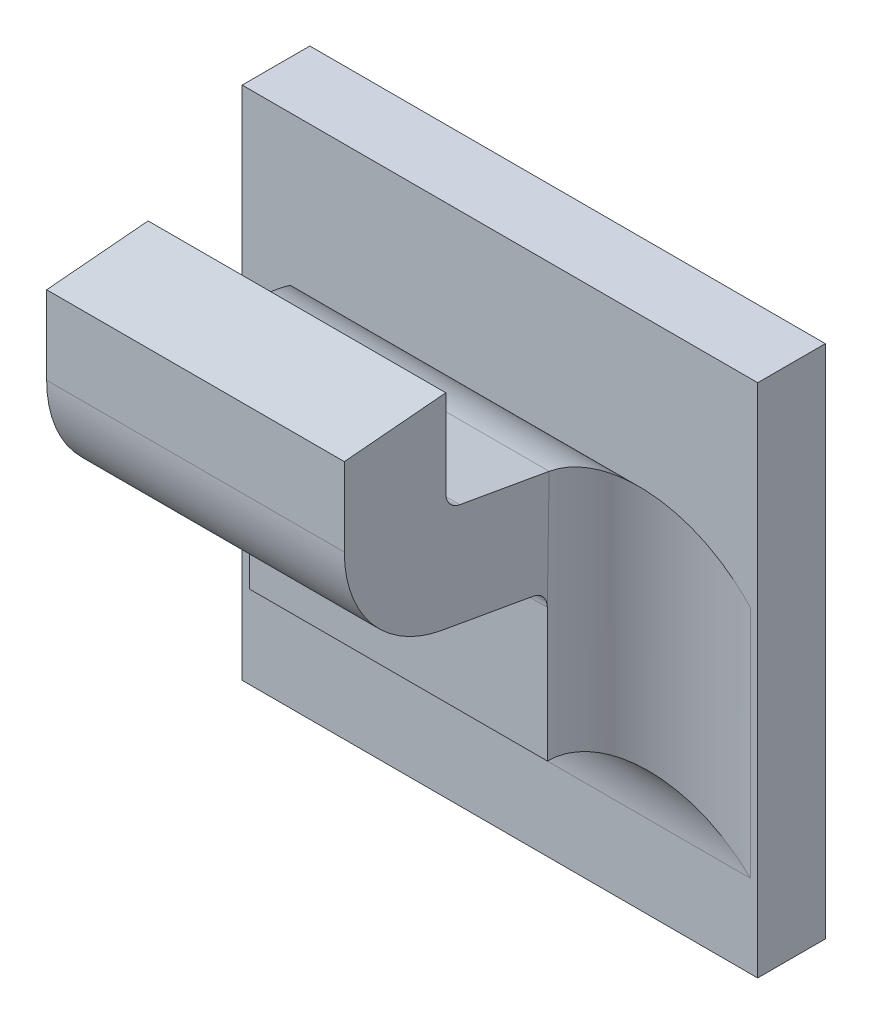
ISO-10303-21;
HEADER;
FILE_DESCRIPTION(('STEP AP214'),'2;1');
FILE_NAME('part.step','',(''),(''),'','','');
FILE_SCHEMA(('AUTOMOTIVE_DESIGN { 1 0 10303 214 1 1 1 1 }'));
ENDSEC;
DATA;
#1=APPLICATION_CONTEXT('core data for automotive mechanical design processes');
#2=APPLICATION_PROTOCOL_DEFINITION('international standard','automotive_design',2000,#1);
#3=PRODUCT_CONTEXT('',#1,'mechanical');
#4=PRODUCT('Part','Part','',(#3));
#5=PRODUCT_RELATED_PRODUCT_CATEGORY('part','',(#4));
#6=PRODUCT_DEFINITION_FORMATION('','',#4);
#7=PRODUCT_DEFINITION_CONTEXT('part definition',#1,'design');
#8=PRODUCT_DEFINITION('design','',#6,#7);
#9=PRODUCT_DEFINITION_SHAPE('','',#8);
#10=(LENGTH_UNIT() NAMED_UNIT(*) SI_UNIT(.MILLI.,.METRE.));
#11=(NAMED_UNIT(*) PLANE_ANGLE_UNIT() SI_UNIT($,.RADIAN.));
#12=(NAMED_UNIT(*) SI_UNIT($,.STERADIAN.) SOLID_ANGLE_UNIT());
#13=UNCERTAINTY_MEASURE_WITH_UNIT(LENGTH_MEASURE(1.E-05),#10,'distance_accuracy_value','');
#14=(GEOMETRIC_REPRESENTATION_CONTEXT(3) GLOBAL_UNCERTAINTY_ASSIGNED_CONTEXT((#13)) GLOBAL_UNIT_ASSIGNED_CONTEXT((#10,
#11,#12)) REPRESENTATION_CONTEXT('',''));
#15=CARTESIAN_POINT('',(0.,0.,0.));
#16=DIRECTION('',(0.,0.,1.));
#17=DIRECTION('',(1.,0.,0.));
#18=AXIS2_PLACEMENT_3D('',#15,#16,#17);
#19=CARTESIAN_POINT('',(-0.50198809134313,-0.481303520617574,0.0797273267071123));
#20=DIRECTION('',(1.,0.,0.));
#21=DIRECTION('',(0.,1.,0.));
#22=AXIS2_PLACEMENT_3D('',#19,#20,#21);
#23=CYLINDRICAL_SURFACE('',#22,0.00098425196850394);
#24=DIRECTION('',(1.,0.,0.));
#25=VECTOR('',#24,1.);
#26=CARTESIAN_POINT('',(-0.521043209453366,-0.481303520617574,0.0807115786756163));
#27=LINE('',#26,#25);
#28=CARTESIAN_POINT('',(-0.502854233075413,-0.481303520617574,0.0807115786756163));
#29=VERTEX_POINT('',#28);
#30=CARTESIAN_POINT('',(-0.520177067721082,-0.481303520617574,0.0807115786756163));
#31=VERTEX_POINT('',#30);
#32=EDGE_CURVE('E182',#29,#31,#27,.F.);
#33=ORIENTED_EDGE('',*,*,#32,.F.);
#34=CARTESIAN_POINT('',(-0.502854233075413,-0.481303520617574,0.0797273267071123));
#35=DIRECTION('',(1.,0.,0.));
#36=DIRECTION('',(0.,1.,0.));
#37=AXIS2_PLACEMENT_3D('',#34,#35,#36);
#38=CIRCLE('',#37,0.00098425196850394);
#39=CARTESIAN_POINT('',(-0.502854233075413,-0.482272819587074,0.0798982402678081));
#40=VERTEX_POINT('',#39);
#41=EDGE_CURVE('E155',#40,#29,#38,.F.);
#42=ORIENTED_EDGE('',*,*,#41,.F.);
#43=DIRECTION('',(1.,0.,0.));
#44=VECTOR('',#43,1.);
#45=CARTESIAN_POINT('',(-0.521047402238024,-0.482272819587074,0.0798982402678081));
#46=LINE('',#45,#44);
#47=CARTESIAN_POINT('',(-0.520177067721082,-0.482272819587074,0.0798982402678081));
#48=VERTEX_POINT('',#47);
#49=EDGE_CURVE('E137',#48,#40,#46,.T.);
#50=ORIENTED_EDGE('',*,*,#49,.F.);
#51=CARTESIAN_POINT('',(-0.520177067721082,-0.481303520617574,0.0797273267071123));
#52=DIRECTION('',(1.,0.,0.));
#53=DIRECTION('',(0.,1.,0.));
#54=AXIS2_PLACEMENT_3D('',#51,#52,#53);
#55=CIRCLE('',#54,0.00098425196850394);
#56=EDGE_CURVE('E148',#48,#31,#55,.F.);
#57=ORIENTED_EDGE('',*,*,#56,.T.);
#58=EDGE_LOOP('',(#33,#42,#50,#57));
#59=FACE_BOUND('',#58,.T.);
#60=ADVANCED_FACE('F17',(#59),#23,.F.);
#61=CARTESIAN_POINT('',(-0.521043209453366,-0.481557363411449,0.0807115786756163));
#62=DIRECTION('',(0.,0.,-1.));
#63=DIRECTION('',(0.,1.,0.));
#64=AXIS2_PLACEMENT_3D('',#61,#62,#63);
#65=PLANE('',#64);
#66=ORIENTED_EDGE('',*,*,#32,.T.);
#67=DIRECTION('',(0.,1.,0.));
#68=VECTOR('',#67,1.);
#69=CARTESIAN_POINT('',(-0.520177067721082,-0.490681533548079,0.0807115786756163));
#70=LINE('',#69,#68);
#71=CARTESIAN_POINT('',(-0.520177067721082,-0.476226664740066,0.0807115786756163));
#72=VERTEX_POINT('',#71);
#73=EDGE_CURVE('E177',#31,#72,#70,.T.);
#74=ORIENTED_EDGE('',*,*,#73,.T.);
#75=DIRECTION('',(1.,0.,0.));
#76=VECTOR('',#75,1.);
#77=CARTESIAN_POINT('',(-0.549015650398248,-0.476226664740067,0.0807115786756162));
#78=LINE('',#77,#76);
#79=CARTESIAN_POINT('',(-0.502854233075413,-0.476226664740066,0.0807115786756163));
#80=VERTEX_POINT('',#79);
#81=EDGE_CURVE('E170',#72,#80,#78,.T.);
#82=ORIENTED_EDGE('',*,*,#81,.T.);
#83=DIRECTION('',(0.,1.,0.));
#84=VECTOR('',#83,1.);
#85=CARTESIAN_POINT('',(-0.502854233075413,-0.490681533548079,0.0807115786756163));
#86=LINE('',#85,#84);
#87=EDGE_CURVE('E189',#29,#80,#86,.T.);
#88=ORIENTED_EDGE('',*,*,#87,.F.);
#89=EDGE_LOOP('',(#66,#74,#82,#88));
#90=FACE_BOUND('',#89,.T.);
#91=ADVANCED_FACE('F376',(#90),#65,.T.);
#92=CARTESIAN_POINT('',(-0.549015650398248,-0.476585262158006,0.0848103659183002));
#93=DIRECTION('',(0.,-0.996194698091746,-0.0871557427476516));
#94=DIRECTION('',(0.,0.0871557427476516,-0.996194698091746));
#95=AXIS2_PLACEMENT_3D('',#92,#93,#94);
#96=PLANE('',#95);
#97=DIRECTION('',(0.,-0.0871557427476615,0.996194698091745));
#98=VECTOR('',#97,1.);
#99=CARTESIAN_POINT('',(-0.502854233075413,-0.476226664740066,0.0807115786756163));
#100=LINE('',#99,#98);
#101=CARTESIAN_POINT('',(-0.502854233075413,-0.476743330075849,0.0866170904866399));
#102=VERTEX_POINT('',#101);
#103=EDGE_CURVE('E186',#80,#102,#100,.T.);
#104=ORIENTED_EDGE('',*,*,#103,.F.);
#105=ORIENTED_EDGE('',*,*,#81,.F.);
#106=DIRECTION('',(0.,-0.0871557427476615,0.996194698091745));
#107=VECTOR('',#106,1.);
#108=CARTESIAN_POINT('',(-0.520177067721082,-0.476226664740066,0.0807115786756163));
#109=LINE('',#108,#107);
#110=CARTESIAN_POINT('',(-0.520177067721082,-0.476743330075849,0.08661709048664));
#111=VERTEX_POINT('',#110);
#112=EDGE_CURVE('E173',#72,#111,#109,.T.);
#113=ORIENTED_EDGE('',*,*,#112,.T.);
#114=DIRECTION('',(1.,0.,0.));
#115=VECTOR('',#114,1.);
#116=CARTESIAN_POINT('',(-0.521043209453366,-0.476743330075849,0.0866170904866399));
#117=LINE('',#116,#115);
#118=EDGE_CURVE('E167',#111,#102,#117,.T.);
#119=ORIENTED_EDGE('',*,*,#118,.T.);
#120=EDGE_LOOP('',(#104,#105,#113,#119));
#121=FACE_BOUND('',#120,.T.);
#122=ADVANCED_FACE('F380',(#121),#96,.F.);
#123=CARTESIAN_POINT('',(-0.521043209453366,-0.48153153014466,0.0866170904866399));
#124=DIRECTION('',(0.,0.,-1.));
#125=DIRECTION('',(0.,1.,0.));
#126=AXIS2_PLACEMENT_3D('',#123,#124,#125);
#127=PLANE('',#126);
#128=ORIENTED_EDGE('',*,*,#118,.F.);
#129=DIRECTION('',(0.,1.,0.));
#130=VECTOR('',#129,1.);
#131=CARTESIAN_POINT('',(-0.520177067721082,-0.490681533548079,0.08661709048664));
#132=LINE('',#131,#130);
#133=CARTESIAN_POINT('',(-0.520177067721082,-0.481303520617574,0.0866170904866399));
#134=VERTEX_POINT('',#133);
#135=EDGE_CURVE('E176',#111,#134,#132,.F.);
#136=ORIENTED_EDGE('',*,*,#135,.T.);
#137=DIRECTION('',(1.,0.,0.));
#138=VECTOR('',#137,1.);
#139=CARTESIAN_POINT('',(-0.50198809134313,-0.481303520617574,0.0866170904866399));
#140=LINE('',#139,#138);
#141=CARTESIAN_POINT('',(-0.502854233075413,-0.481303520617574,0.0866170904866399));
#142=VERTEX_POINT('',#141);
#143=EDGE_CURVE('E165',#142,#134,#140,.F.);
#144=ORIENTED_EDGE('',*,*,#143,.F.);
#145=DIRECTION('',(0.,1.,0.));
#146=VECTOR('',#145,1.);
#147=CARTESIAN_POINT('',(-0.502854233075413,-0.490681533548079,0.08661709048664));
#148=LINE('',#147,#146);
#149=EDGE_CURVE('E188',#102,#142,#148,.F.);
#150=ORIENTED_EDGE('',*,*,#149,.F.);
#151=EDGE_LOOP('',(#128,#136,#144,#150));
#152=FACE_BOUND('',#151,.T.);
#153=ADVANCED_FACE('F384',(#152),#127,.F.);
#154=CARTESIAN_POINT('',(-0.50198809134313,-0.481303520617574,0.0797273267071123));
#155=DIRECTION('',(1.,0.,0.));
#156=DIRECTION('',(0.,1.,0.));
#157=AXIS2_PLACEMENT_3D('',#154,#155,#156);
#158=CYLINDRICAL_SURFACE('',#157,0.00688976377952756);
#159=CARTESIAN_POINT('',(-0.502854233075413,-0.481303520617574,0.0797273267071123));
#160=DIRECTION('',(1.,0.,0.));
#161=DIRECTION('',(0.,1.,0.));
#162=AXIS2_PLACEMENT_3D('',#159,#160,#161);
#163=CIRCLE('',#162,0.00688976377952756);
#164=CARTESIAN_POINT('',(-0.502854233075413,-0.488088613404075,0.0809237216319831));
#165=VERTEX_POINT('',#164);
#166=EDGE_CURVE('E146',#142,#165,#163,.T.);
#167=ORIENTED_EDGE('',*,*,#166,.F.);
#168=ORIENTED_EDGE('',*,*,#143,.T.);
#169=CARTESIAN_POINT('',(-0.520177067721082,-0.481303520617574,0.0797273267071123));
#170=DIRECTION('',(1.,0.,0.));
#171=DIRECTION('',(0.,1.,0.));
#172=AXIS2_PLACEMENT_3D('',#169,#170,#171);
#173=CIRCLE('',#172,0.00688976377952756);
#174=CARTESIAN_POINT('',(-0.520177067721082,-0.488088613404075,0.0809237216319831));
#175=VERTEX_POINT('',#174);
#176=EDGE_CURVE('E235',#134,#175,#173,.T.);
#177=ORIENTED_EDGE('',*,*,#176,.T.);
#178=DIRECTION('',(1.,0.,0.));
#179=VECTOR('',#178,1.);
#180=CARTESIAN_POINT('',(-0.521043209453366,-0.488088613404075,0.0809237216319829));
#181=LINE('',#180,#179);
#182=EDGE_CURVE('E138',#175,#165,#181,.T.);
#183=ORIENTED_EDGE('',*,*,#182,.T.);
#184=EDGE_LOOP('',(#167,#168,#177,#183));
#185=FACE_BOUND('',#184,.T.);
#186=ADVANCED_FACE('F388',(#185),#158,.T.);
#187=CARTESIAN_POINT('',(-0.521043209453366,-0.489070672196903,0.0753541894544217));
#188=DIRECTION('',(0.,0.984807753012208,-0.17364817766693));
#189=DIRECTION('',(0.,0.17364817766693,0.984807753012208));
#190=AXIS2_PLACEMENT_3D('',#187,#188,#189);
#191=PLANE('',#190);
#192=DIRECTION('',(1.,0.,0.));
#193=VECTOR('',#192,1.);
#194=CARTESIAN_POINT('',(-0.50198809134313,-0.489023907492483,0.0756194052724008));
#195=LINE('',#194,#193);
#196=CARTESIAN_POINT('',(-0.520177067721082,-0.489023907492483,0.0756194052724008));
#197=VERTEX_POINT('',#196);
#198=CARTESIAN_POINT('',(-0.502854233075413,-0.489023907492483,0.0756194052724008));
#199=VERTEX_POINT('',#198);
#200=EDGE_CURVE('E127',#197,#199,#195,.T.);
#201=ORIENTED_EDGE('',*,*,#200,.T.);
#202=DIRECTION('',(0.,-0.173648177666989,-0.984807753012198));
#203=VECTOR('',#202,1.);
#204=CARTESIAN_POINT('',(-0.502854233075413,-0.488088613404075,0.0809237216319829));
#205=LINE('',#204,#203);
#206=EDGE_CURVE('E130',#165,#199,#205,.T.);
#207=ORIENTED_EDGE('',*,*,#206,.F.);
#208=ORIENTED_EDGE('',*,*,#182,.F.);
#209=DIRECTION('',(0.,-0.173648177666989,-0.984807753012198));
#210=VECTOR('',#209,1.);
#211=CARTESIAN_POINT('',(-0.520177067721082,-0.488088613404075,0.0809237216319829));
#212=LINE('',#211,#210);
#213=EDGE_CURVE('E132',#175,#197,#212,.T.);
#214=ORIENTED_EDGE('',*,*,#213,.T.);
#215=EDGE_LOOP('',(#201,#207,#208,#214));
#216=FACE_BOUND('',#215,.T.);
#217=ADVANCED_FACE('F129',(#216),#191,.F.);
#218=CARTESIAN_POINT('',(-0.50198809134313,-0.489993206461983,0.0757903188330966));
#219=DIRECTION('',(1.,0.,0.));
#220=DIRECTION('',(0.,1.,0.));
#221=AXIS2_PLACEMENT_3D('',#218,#219,#220);
#222=CYLINDRICAL_SURFACE('',#221,0.00098425196850394);
#223=DIRECTION('',(1.,0.,0.));
#224=VECTOR('',#223,1.);
#225=CARTESIAN_POINT('',(-0.521043209453366,-0.489993206461983,0.0748060668645926));
#226=LINE('',#225,#224);
#227=CARTESIAN_POINT('',(-0.520177067721082,-0.489993206461983,0.0748060668645927));
#228=VERTEX_POINT('',#227);
#229=CARTESIAN_POINT('',(-0.502854233075413,-0.489993206461983,0.0748060668645926));
#230=VERTEX_POINT('',#229);
#231=EDGE_CURVE('E151',#228,#230,#226,.T.);
#232=ORIENTED_EDGE('',*,*,#231,.T.);
#233=CARTESIAN_POINT('',(-0.502854233075413,-0.489993206461983,0.0757903188330966));
#234=DIRECTION('',(1.,0.,0.));
#235=DIRECTION('',(0.,1.,0.));
#236=AXIS2_PLACEMENT_3D('',#233,#234,#235);
#237=CIRCLE('',#236,0.00098425196850394);
#238=EDGE_CURVE('E20',#199,#230,#237,.F.);
#239=ORIENTED_EDGE('',*,*,#238,.F.);
#240=ORIENTED_EDGE('',*,*,#200,.F.);
#241=CARTESIAN_POINT('',(-0.520177067721082,-0.489993206461983,0.0757903188330966));
#242=DIRECTION('',(1.,0.,0.));
#243=DIRECTION('',(0.,1.,0.));
#244=AXIS2_PLACEMENT_3D('',#241,#242,#243);
#245=CIRCLE('',#244,0.00098425196850394);
#246=EDGE_CURVE('E232',#197,#228,#245,.F.);
#247=ORIENTED_EDGE('',*,*,#246,.T.);
#248=EDGE_LOOP('',(#232,#239,#240,#247));
#249=FACE_BOUND('',#248,.T.);
#250=ADVANCED_FACE('F150',(#249),#222,.F.);
#251=CARTESIAN_POINT('',(-0.521047402238024,-0.483254878379902,0.0743287080902469));
#252=DIRECTION('',(0.,0.984807753012208,-0.17364817766693));
#253=DIRECTION('',(0.,0.17364817766693,0.984807753012208));
#254=AXIS2_PLACEMENT_3D('',#251,#252,#253);
#255=PLANE('',#254);
#256=DIRECTION('',(0.,0.173648177666938,0.984807753012207));
#257=VECTOR('',#256,1.);
#258=CARTESIAN_POINT('',(-0.502854233075413,-0.483170707148507,0.0748060668645927));
#259=LINE('',#258,#257);
#260=CARTESIAN_POINT('',(-0.502852327264205,-0.483189410411994,0.0746999953864093));
#261=VERTEX_POINT('',#260);
#262=EDGE_CURVE('E153',#261,#40,#259,.T.);
#263=ORIENTED_EDGE('',*,*,#262,.F.);
#264=DIRECTION('',(1.,0.,0.));
#265=VECTOR('',#264,1.);
#266=CARTESIAN_POINT('',(-0.495492028351004,-0.483208113675482,0.0745939239082259));
#267=LINE('',#266,#265);
#268=CARTESIAN_POINT('',(-0.52017897353229,-0.483189410411994,0.0746999953864093));
#269=VERTEX_POINT('',#268);
#270=EDGE_CURVE('E264',#269,#261,#267,.T.);
#271=ORIENTED_EDGE('',*,*,#270,.F.);
#272=DIRECTION('',(0.,0.173648177666938,0.984807753012207));
#273=VECTOR('',#272,1.);
#274=CARTESIAN_POINT('',(-0.520177067721082,-0.483170707148507,0.0748060668645927));
#275=LINE('',#274,#273);
#276=EDGE_CURVE('E234',#269,#48,#275,.T.);
#277=ORIENTED_EDGE('',*,*,#276,.T.);
#278=ORIENTED_EDGE('',*,*,#49,.T.);
#279=EDGE_LOOP('',(#263,#271,#277,#278));
#280=FACE_BOUND('',#279,.T.);
#281=ADVANCED_FACE('F373',(#280),#255,.T.);
#282=CARTESIAN_POINT('',(-0.502854233075413,-0.490681533548079,0.0742155156834903));
#283=DIRECTION('',(1.,0.,0.));
#284=DIRECTION('',(0.,1.,0.));
#285=AXIS2_PLACEMENT_3D('',#282,#283,#284);
#286=PLANE('',#285);
#287=ORIENTED_EDGE('',*,*,#166,.T.);
#288=ORIENTED_EDGE('',*,*,#206,.T.);
#289=ORIENTED_EDGE('',*,*,#238,.T.);
#290=DIRECTION('',(0.,-1.,0.));
#291=VECTOR('',#290,1.);
#292=CARTESIAN_POINT('',(-0.502854233075414,-0.504665225306676,0.0748060668645926));
#293=LINE('',#292,#291);
#294=EDGE_CURVE('E271',#230,#261,#293,.F.);
#295=ORIENTED_EDGE('',*,*,#294,.T.);
#296=ORIENTED_EDGE('',*,*,#262,.T.);
#297=ORIENTED_EDGE('',*,*,#41,.T.);
#298=ORIENTED_EDGE('',*,*,#87,.T.);
#299=ORIENTED_EDGE('',*,*,#103,.T.);
#300=ORIENTED_EDGE('',*,*,#149,.T.);
#301=EDGE_LOOP('',(#287,#288,#289,#295,#296,#297,#298,#299,#300));
#302=FACE_BOUND('',#301,.T.);
#303=ADVANCED_FACE('F142',(#302),#286,.T.);
#304=CARTESIAN_POINT('',(-0.520177067721082,-0.490681533548079,0.0742155156834903));
#305=DIRECTION('',(1.,0.,0.));
#306=DIRECTION('',(0.,1.,0.));
#307=AXIS2_PLACEMENT_3D('',#304,#305,#306);
#308=PLANE('',#307);
#309=DIRECTION('',(0.,1.,0.));
#310=VECTOR('',#309,1.);
#311=CARTESIAN_POINT('',(-0.520177067721082,-0.482147158664785,0.0748060668645927));
#312=LINE('',#311,#310);
#313=EDGE_CURVE('E290',#269,#228,#312,.F.);
#314=ORIENTED_EDGE('',*,*,#313,.T.);
#315=ORIENTED_EDGE('',*,*,#246,.F.);
#316=ORIENTED_EDGE('',*,*,#213,.F.);
#317=ORIENTED_EDGE('',*,*,#176,.F.);
#318=ORIENTED_EDGE('',*,*,#135,.F.);
#319=ORIENTED_EDGE('',*,*,#112,.F.);
#320=ORIENTED_EDGE('',*,*,#73,.F.);
#321=ORIENTED_EDGE('',*,*,#56,.F.);
#322=ORIENTED_EDGE('',*,*,#276,.F.);
#323=EDGE_LOOP('',(#314,#315,#316,#317,#318,#319,#320,#321,#322));
#324=FACE_BOUND('',#323,.T.);
#325=ADVANCED_FACE('F371',(#324),#308,.F.);
#326=CARTESIAN_POINT('',(-0.521043209453366,-0.498123312939428,0.0748060668645926));
#327=DIRECTION('',(0.,0.,-1.));
#328=DIRECTION('',(0.,1.,0.));
#329=AXIS2_PLACEMENT_3D('',#326,#327,#328);
#330=PLANE('',#329);
#331=DIRECTION('',(-1.,0.,0.));
#332=VECTOR('',#331,1.);
#333=CARTESIAN_POINT('',(-0.549015650398248,-0.49773616501193,0.0748060668645926));
#334=LINE('',#333,#332);
#335=CARTESIAN_POINT('',(-0.520177067721082,-0.49773616501193,0.0748060668645926));
#336=VERTEX_POINT('',#335);
#337=CARTESIAN_POINT('',(-0.502854233075414,-0.49773616501193,0.0748060668645926));
#338=VERTEX_POINT('',#337);
#339=EDGE_CURVE('E275',#336,#338,#334,.F.);
#340=ORIENTED_EDGE('',*,*,#339,.T.);
#341=DIRECTION('',(0.,-1.,0.));
#342=VECTOR('',#341,1.);
#343=CARTESIAN_POINT('',(-0.502854233075414,-0.504665225306676,0.0748060668645926));
#344=LINE('',#343,#342);
#345=EDGE_CURVE('E268',#338,#230,#344,.F.);
#346=ORIENTED_EDGE('',*,*,#345,.T.);
#347=ORIENTED_EDGE('',*,*,#231,.F.);
#348=DIRECTION('',(0.,1.,0.));
#349=VECTOR('',#348,1.);
#350=CARTESIAN_POINT('',(-0.520177067721082,-0.482147158664785,0.0748060668645926));
#351=LINE('',#350,#349);
#352=EDGE_CURVE('E293',#228,#336,#351,.F.);
#353=ORIENTED_EDGE('',*,*,#352,.T.);
#354=EDGE_LOOP('',(#340,#346,#347,#353));
#355=FACE_BOUND('',#354,.T.);
#356=ADVANCED_FACE('F369',(#355),#330,.F.);
#357=CARTESIAN_POINT('',(-0.495492028351004,-0.489993206461983,0.0757903188330966));
#358=DIRECTION('',(1.,0.,0.));
#359=DIRECTION('',(0.,1.,0.));
#360=AXIS2_PLACEMENT_3D('',#357,#358,#359);
#361=CYLINDRICAL_SURFACE('',#360,0.00688976377952756);
#362=ORIENTED_EDGE('',*,*,#270,.T.);
#363=CARTESIAN_POINT('',(-0.502853227099264,-0.483190299054108,0.0747001216257358));
#364=CARTESIAN_POINT('',(-0.502848327751097,-0.483237076502032,0.074405223433363));
#365=CARTESIAN_POINT('',(-0.502820725120362,-0.48330363441383,0.074115034151789));
#366=CARTESIAN_POINT('',(-0.502726784768239,-0.483470149648069,0.073553844729337));
#367=CARTESIAN_POINT('',(-0.502660815248929,-0.483569785675541,0.0732826892737776));
#368=CARTESIAN_POINT('',(-0.502496831530718,-0.483796900902092,0.0727646055784551));
#369=CARTESIAN_POINT('',(-0.502398954406138,-0.48392426023827,0.0725175794773051));
#370=CARTESIAN_POINT('',(-0.502177352949507,-0.484201625658181,0.0720485533086557));
#371=CARTESIAN_POINT('',(-0.502053561864929,-0.484351689945956,0.0718266201983145));
#372=CARTESIAN_POINT('',(-0.50171729390458,-0.484750708379493,0.0713022915327615));
#373=CARTESIAN_POINT('',(-0.50149184432977,-0.485010979657895,0.0710168133445037));
#374=CARTESIAN_POINT('',(-0.501009767700218,-0.485558615462719,0.0705040567027229));
#375=CARTESIAN_POINT('',(-0.500753069178619,-0.485846041744032,0.0702769154978245));
#376=CARTESIAN_POINT('',(-0.500119018974546,-0.486549705339456,0.0698026326616958));
#377=CARTESIAN_POINT('',(-0.499732430345046,-0.486973936440458,0.0695797433223628));
#378=CARTESIAN_POINT('',(-0.498938574176521,-0.487840056506252,0.0692289934880922));
#379=CARTESIAN_POINT('',(-0.498531322381542,-0.488281931974037,0.0691010617693635));
#380=CARTESIAN_POINT('',(-0.497849654493482,-0.489019814551546,0.0689631980798835));
#381=CARTESIAN_POINT('',(-0.497577774613566,-0.489313668588468,0.0689278051732856));
#382=CARTESIAN_POINT('',(-0.497186541195021,-0.4897363315112,0.0689041494171859));
#383=CARTESIAN_POINT('',(-0.49706762576773,-0.489864774668986,0.068900564537093));
#384=CARTESIAN_POINT('',(-0.49694872126439,-0.489993206461983,0.068900555053569));
#385=B_SPLINE_CURVE_WITH_KNOTS('',3,(#363,#364,#365,#366,#367,#368,#369,#370,#371,#372,#373,
#374,#375,#376,#377,#378,#379,#380,#381,#382,#383,#384),.UNSPECIFIED.,.F.,.F.,(4,2,2,2,2,2,2,2,
2,2,4),(0.,0.000892674275674714,0.00177691981761754,0.00265741564566992,0.00354020811045538,
0.00487460341316204,0.0062121099507397,0.00804949445936681,0.00988549942521255,
0.0110894312839999,0.0116145091100795),.UNSPECIFIED.);
#386=CARTESIAN_POINT('',(-0.49694872126439,-0.489993206461983,0.068900555053569));
#387=VERTEX_POINT('',#386);
#388=EDGE_CURVE('E231',#261,#387,#385,.T.);
#389=ORIENTED_EDGE('',*,*,#388,.T.);
#390=DIRECTION('',(1.,0.,0.));
#391=VECTOR('',#390,1.);
#392=CARTESIAN_POINT('',(-0.549015650398248,-0.489993206461983,0.068900555053569));
#393=LINE('',#392,#391);
#394=CARTESIAN_POINT('',(-0.526082579532106,-0.489993206461983,0.068900555053569));
#395=VERTEX_POINT('',#394);
#396=EDGE_CURVE('E195',#395,#387,#393,.T.);
#397=ORIENTED_EDGE('',*,*,#396,.F.);
#398=CARTESIAN_POINT('',(-0.520178073697231,-0.483190299054108,0.0747001216257358));
#399=CARTESIAN_POINT('',(-0.520182973045398,-0.483237076502032,0.074405223433363));
#400=CARTESIAN_POINT('',(-0.520210575676134,-0.483303634413829,0.074115034151789));
#401=CARTESIAN_POINT('',(-0.520304516028257,-0.483470149648069,0.073553844729337));
#402=CARTESIAN_POINT('',(-0.520370485547567,-0.48356978567554,0.0732826892737776));
#403=CARTESIAN_POINT('',(-0.520534469265779,-0.483796900902092,0.0727646055784551));
#404=CARTESIAN_POINT('',(-0.520632346390358,-0.48392426023827,0.0725175794773051));
#405=CARTESIAN_POINT('',(-0.520853947846989,-0.484201625658181,0.0720485533086557));
#406=CARTESIAN_POINT('',(-0.520977738931567,-0.484351689945956,0.0718266201983145));
#407=CARTESIAN_POINT('',(-0.521314006891916,-0.484750708379493,0.0713022915327615));
#408=CARTESIAN_POINT('',(-0.521539456466726,-0.485010979657895,0.0710168133445036));
#409=CARTESIAN_POINT('',(-0.522021533096278,-0.485558615462719,0.0705040567027228));
#410=CARTESIAN_POINT('',(-0.522278231617877,-0.485846041744032,0.0702769154978244));
#411=CARTESIAN_POINT('',(-0.52291228182195,-0.486549705339456,0.0698026326616957));
#412=CARTESIAN_POINT('',(-0.523298870451451,-0.486973936440458,0.0695797433223628));
#413=CARTESIAN_POINT('',(-0.524092726619975,-0.487840056506252,0.0692289934880922));
#414=CARTESIAN_POINT('',(-0.524499978414954,-0.488281931974037,0.0691010617693635));
#415=CARTESIAN_POINT('',(-0.525181646303014,-0.489019814551546,0.0689631980798835));
#416=CARTESIAN_POINT('',(-0.525453526182931,-0.489313668588467,0.0689278051732857));
#417=CARTESIAN_POINT('',(-0.525844759601475,-0.489736331511199,0.0689041494171859));
#418=CARTESIAN_POINT('',(-0.525963675028766,-0.489864774668985,0.0689005645370931));
#419=CARTESIAN_POINT('',(-0.526082579532106,-0.489993206461983,0.0689005550535691));
#420=B_SPLINE_CURVE_WITH_KNOTS('',3,(#398,#399,#400,#401,#402,#403,#404,#405,#406,#407,#408,
#409,#410,#411,#412,#413,#414,#415,#416,#417,#418,#419),.UNSPECIFIED.,.F.,.F.,(4,2,2,2,2,2,2,2,
2,2,4),(0.,0.000892674275674704,0.00177691981761762,0.00265741564566998,0.00354020811045551,
0.00487460341316218,0.00621210995073994,0.0080494944593671,0.00988549942521283,
0.0110894312839998,0.0116145091100795),.UNSPECIFIED.);
#421=EDGE_CURVE('E192',#395,#269,#420,.F.);
#422=ORIENTED_EDGE('',*,*,#421,.T.);
#423=EDGE_LOOP('',(#362,#389,#397,#422));
#424=FACE_BOUND('',#423,.T.);
#425=ADVANCED_FACE('F205',(#424),#361,.T.);
#426=CARTESIAN_POINT('',(-0.49694872126439,-0.504665225306676,0.0748060668645926));
#427=DIRECTION('',(0.,-1.,0.));
#428=DIRECTION('',(1.,0.,0.));
#429=AXIS2_PLACEMENT_3D('',#426,#427,#428);
#430=CYLINDRICAL_SURFACE('',#429,0.00590551181102362);
#431=ORIENTED_EDGE('',*,*,#345,.F.);
#432=CARTESIAN_POINT('',(-0.49694872126439,-0.503641676822954,0.0748060668645926));
#433=DIRECTION('',(-0.707106781186548,-0.707106781186547,0.));
#434=DIRECTION('',(0.707106781186547,-0.707106781186548,0.));
#435=AXIS2_PLACEMENT_3D('',#432,#433,#434);
#436=ELLIPSE('',#435,0.0083516548959041,0.00590551181102362);
#437=CARTESIAN_POINT('',(-0.49694872126439,-0.503641676822954,0.068900555053569));
#438=VERTEX_POINT('',#437);
#439=EDGE_CURVE('E281',#338,#438,#436,.T.);
#440=ORIENTED_EDGE('',*,*,#439,.T.);
#441=DIRECTION('',(0.,-1.,0.));
#442=VECTOR('',#441,1.);
#443=CARTESIAN_POINT('',(-0.49694872126439,-0.449184274957739,0.068900555053569));
#444=LINE('',#443,#442);
#445=EDGE_CURVE('E276',#387,#438,#444,.T.);
#446=ORIENTED_EDGE('',*,*,#445,.F.);
#447=ORIENTED_EDGE('',*,*,#388,.F.);
#448=ORIENTED_EDGE('',*,*,#294,.F.);
#449=EDGE_LOOP('',(#431,#440,#446,#447,#448));
#450=FACE_BOUND('',#449,.T.);
#451=ADVANCED_FACE('F219',(#450),#430,.F.);
#452=CARTESIAN_POINT('',(-0.549015650398248,-0.503641676822954,0.0748060668645926));
#453=DIRECTION('',(-1.,0.,0.));
#454=DIRECTION('',(0.,-1.,0.));
#455=AXIS2_PLACEMENT_3D('',#452,#453,#454);
#456=CYLINDRICAL_SURFACE('',#455,0.00590551181102362);
#457=DIRECTION('',(1.,0.,0.));
#458=VECTOR('',#457,1.);
#459=CARTESIAN_POINT('',(-0.549015650398248,-0.503641676822954,0.068900555053569));
#460=LINE('',#459,#458);
#461=CARTESIAN_POINT('',(-0.526082579532106,-0.503641676822954,0.068900555053569));
#462=VERTEX_POINT('',#461);
#463=EDGE_CURVE('E278',#438,#462,#460,.F.);
#464=ORIENTED_EDGE('',*,*,#463,.F.);
#465=ORIENTED_EDGE('',*,*,#439,.F.);
#466=ORIENTED_EDGE('',*,*,#339,.F.);
#467=CARTESIAN_POINT('',(-0.526082579532106,-0.503641676822954,0.0748060668645927));
#468=DIRECTION('',(-0.707106781186547,0.707106781186548,0.));
#469=DIRECTION('',(-0.707106781186548,-0.707106781186547,0.));
#470=AXIS2_PLACEMENT_3D('',#467,#468,#469);
#471=ELLIPSE('',#470,0.0083516548959041,0.00590551181102362);
#472=EDGE_CURVE('E196',#336,#462,#471,.T.);
#473=ORIENTED_EDGE('',*,*,#472,.T.);
#474=EDGE_LOOP('',(#464,#465,#466,#473));
#475=FACE_BOUND('',#474,.T.);
#476=ADVANCED_FACE('F215',(#475),#456,.F.);
#477=CARTESIAN_POINT('',(-0.526082579532106,-0.482147158664785,0.0748060668645927));
#478=DIRECTION('',(0.,1.,0.));
#479=DIRECTION('',(-1.,0.,0.));
#480=AXIS2_PLACEMENT_3D('',#477,#478,#479);
#481=CYLINDRICAL_SURFACE('',#480,0.00590551181102362);
#482=DIRECTION('',(0.,-1.,0.));
#483=VECTOR('',#482,1.);
#484=CARTESIAN_POINT('',(-0.526082579532106,-0.449184274957739,0.068900555053569));
#485=LINE('',#484,#483);
#486=EDGE_CURVE('E283',#462,#395,#485,.F.);
#487=ORIENTED_EDGE('',*,*,#486,.F.);
#488=ORIENTED_EDGE('',*,*,#472,.F.);
#489=ORIENTED_EDGE('',*,*,#352,.F.);
#490=ORIENTED_EDGE('',*,*,#313,.F.);
#491=ORIENTED_EDGE('',*,*,#421,.F.);
#492=EDGE_LOOP('',(#487,#488,#489,#490,#491));
#493=FACE_BOUND('',#492,.T.);
#494=ADVANCED_FACE('F209',(#493),#481,.F.);
#495=CARTESIAN_POINT('',(-0.549015650398248,-0.449184274957739,0.068900555053569));
#496=DIRECTION('',(0.,0.,1.));
#497=DIRECTION('',(0.,-1.,0.));
#498=AXIS2_PLACEMENT_3D('',#495,#496,#497);
#499=PLANE('',#498);
#500=ORIENTED_EDGE('',*,*,#463,.T.);
#501=ORIENTED_EDGE('',*,*,#486,.T.);
#502=ORIENTED_EDGE('',*,*,#396,.T.);
#503=ORIENTED_EDGE('',*,*,#445,.T.);
#504=EDGE_LOOP('',(#500,#501,#502,#503));
#505=FACE_BOUND('',#504,.T.);
#506=DIRECTION('',(0.,-1.,0.));
#507=VECTOR('',#506,1.);
#508=CARTESIAN_POINT('',(-0.496515650398248,-0.476955627617741,0.068900555053569));
#509=LINE('',#508,#507);
#510=CARTESIAN_POINT('',(-0.496515650398248,-0.508455627617741,0.068900555053569));
#511=VERTEX_POINT('',#510);
#512=CARTESIAN_POINT('',(-0.496515650398248,-0.478455627617741,0.068900555053569));
#513=VERTEX_POINT('',#512);
#514=EDGE_CURVE('E300',#511,#513,#509,.F.);
#515=ORIENTED_EDGE('',*,*,#514,.T.);
#516=DIRECTION('',(1.,0.,0.));
#517=VECTOR('',#516,1.);
#518=CARTESIAN_POINT('',(-0.528015650398248,-0.478455627617741,0.068900555053569));
#519=LINE('',#518,#517);
#520=CARTESIAN_POINT('',(-0.526515650398248,-0.478455627617741,0.068900555053569));
#521=VERTEX_POINT('',#520);
#522=EDGE_CURVE('E305',#513,#521,#519,.F.);
#523=ORIENTED_EDGE('',*,*,#522,.T.);
#524=DIRECTION('',(0.,1.,0.));
#525=VECTOR('',#524,1.);
#526=CARTESIAN_POINT('',(-0.526515650398248,-0.509955627617741,0.068900555053569));
#527=LINE('',#526,#525);
#528=CARTESIAN_POINT('',(-0.526515650398248,-0.508455627617741,0.068900555053569));
#529=VERTEX_POINT('',#528);
#530=EDGE_CURVE('E308',#521,#529,#527,.F.);
#531=ORIENTED_EDGE('',*,*,#530,.T.);
#532=DIRECTION('',(-1.,0.,0.));
#533=VECTOR('',#532,1.);
#534=CARTESIAN_POINT('',(-0.495015650398248,-0.508455627617741,0.068900555053569));
#535=LINE('',#534,#533);
#536=EDGE_CURVE('E286',#529,#511,#535,.F.);
#537=ORIENTED_EDGE('',*,*,#536,.T.);
#538=EDGE_LOOP('',(#515,#523,#531,#537));
#539=FACE_BOUND('',#538,.T.);
#540=ADVANCED_FACE('F214',(#505,#539),#499,.T.);
#541=CARTESIAN_POINT('',(-0.495015650398248,-0.508455627617741,0.0647666967858525));
#542=DIRECTION('',(0.,1.,0.));
#543=DIRECTION('',(-1.,0.,0.));
#544=AXIS2_PLACEMENT_3D('',#541,#542,#543);
#545=PLANE('',#544);
#546=DIRECTION('',(0.,0.,1.));
#547=VECTOR('',#546,1.);
#548=CARTESIAN_POINT('',(-0.496515650398248,-0.508455627617741,0.0647666967858525));
#549=LINE('',#548,#547);
#550=CARTESIAN_POINT('',(-0.496515650398248,-0.508455627617741,0.0649635471795533));
#551=VERTEX_POINT('',#550);
#552=EDGE_CURVE('E297',#551,#511,#549,.T.);
#553=ORIENTED_EDGE('',*,*,#552,.T.);
#554=ORIENTED_EDGE('',*,*,#536,.F.);
#555=DIRECTION('',(0.,0.,1.));
#556=VECTOR('',#555,1.);
#557=CARTESIAN_POINT('',(-0.526515650398248,-0.508455627617741,0.0647666967858525));
#558=LINE('',#557,#556);
#559=CARTESIAN_POINT('',(-0.526515650398248,-0.508455627617741,0.0649635471795533));
#560=VERTEX_POINT('',#559);
#561=EDGE_CURVE('E311',#529,#560,#558,.F.);
#562=ORIENTED_EDGE('',*,*,#561,.T.);
#563=DIRECTION('',(1.,0.,0.));
#564=VECTOR('',#563,1.);
#565=CARTESIAN_POINT('',(-0.549015650398248,-0.508455627617741,0.0649635471795533));
#566=LINE('',#565,#564);
#567=EDGE_CURVE('E314',#560,#551,#566,.T.);
#568=ORIENTED_EDGE('',*,*,#567,.T.);
#569=EDGE_LOOP('',(#553,#554,#562,#568));
#570=FACE_BOUND('',#569,.T.);
#571=ADVANCED_FACE('F332',(#570),#545,.F.);
#572=CARTESIAN_POINT('',(-0.496515650398248,-0.476955627617741,0.0647666967858525));
#573=DIRECTION('',(-1.,0.,0.));
#574=DIRECTION('',(0.,-1.,0.));
#575=AXIS2_PLACEMENT_3D('',#572,#573,#574);
#576=PLANE('',#575);
#577=DIRECTION('',(0.,0.,1.));
#578=VECTOR('',#577,1.);
#579=CARTESIAN_POINT('',(-0.496515650398248,-0.478455627617741,0.0647666967858525));
#580=LINE('',#579,#578);
#581=CARTESIAN_POINT('',(-0.496515650398248,-0.478455627617741,0.0649635471795533));
#582=VERTEX_POINT('',#581);
#583=EDGE_CURVE('E302',#582,#513,#580,.T.);
#584=ORIENTED_EDGE('',*,*,#583,.T.);
#585=ORIENTED_EDGE('',*,*,#514,.F.);
#586=ORIENTED_EDGE('',*,*,#552,.F.);
#587=DIRECTION('',(0.,-1.,0.));
#588=VECTOR('',#587,1.);
#589=CARTESIAN_POINT('',(-0.496515650398248,-0.449184274957739,0.0649635471795533));
#590=LINE('',#589,#588);
#591=EDGE_CURVE('E317',#551,#582,#590,.F.);
#592=ORIENTED_EDGE('',*,*,#591,.T.);
#593=EDGE_LOOP('',(#584,#585,#586,#592));
#594=FACE_BOUND('',#593,.T.);
#595=ADVANCED_FACE('F329',(#594),#576,.F.);
#596=CARTESIAN_POINT('',(-0.528015650398248,-0.478455627617741,0.0647666967858525));
#597=DIRECTION('',(0.,-1.,0.));
#598=DIRECTION('',(1.,0.,0.));
#599=AXIS2_PLACEMENT_3D('',#596,#597,#598);
#600=PLANE('',#599);
#601=DIRECTION('',(0.,0.,1.));
#602=VECTOR('',#601,1.);
#603=CARTESIAN_POINT('',(-0.526515650398248,-0.478455627617741,0.0647666967858525));
#604=LINE('',#603,#602);
#605=CARTESIAN_POINT('',(-0.526515650398248,-0.478455627617741,0.0649635471795533));
#606=VERTEX_POINT('',#605);
#607=EDGE_CURVE('E34',#606,#521,#604,.T.);
#608=ORIENTED_EDGE('',*,*,#607,.T.);
#609=ORIENTED_EDGE('',*,*,#522,.F.);
#610=ORIENTED_EDGE('',*,*,#583,.F.);
#611=DIRECTION('',(1.,0.,0.));
#612=VECTOR('',#611,1.);
#613=CARTESIAN_POINT('',(-0.549015650398248,-0.478455627617741,0.0649635471795533));
#614=LINE('',#613,#612);
#615=EDGE_CURVE('E26',#582,#606,#614,.F.);
#616=ORIENTED_EDGE('',*,*,#615,.T.);
#617=EDGE_LOOP('',(#608,#609,#610,#616));
#618=FACE_BOUND('',#617,.T.);
#619=ADVANCED_FACE('F323',(#618),#600,.F.);
#620=CARTESIAN_POINT('',(-0.526515650398248,-0.509955627617741,0.0647666967858525));
#621=DIRECTION('',(1.,0.,0.));
#622=DIRECTION('',(0.,1.,0.));
#623=AXIS2_PLACEMENT_3D('',#620,#621,#622);
#624=PLANE('',#623);
#625=ORIENTED_EDGE('',*,*,#561,.F.);
#626=ORIENTED_EDGE('',*,*,#530,.F.);
#627=ORIENTED_EDGE('',*,*,#607,.F.);
#628=DIRECTION('',(0.,-1.,0.));
#629=VECTOR('',#628,1.);
#630=CARTESIAN_POINT('',(-0.526515650398248,-0.449184274957739,0.0649635471795533));
#631=LINE('',#630,#629);
#632=EDGE_CURVE('E11',#606,#560,#631,.T.);
#633=ORIENTED_EDGE('',*,*,#632,.T.);
#634=EDGE_LOOP('',(#625,#626,#627,#633));
#635=FACE_BOUND('',#634,.T.);
#636=ADVANCED_FACE('F334',(#635),#624,.F.);
#637=CARTESIAN_POINT('',(-0.549015650398248,-0.449184274957739,0.0649635471795533));
#638=DIRECTION('',(0.,0.,1.));
#639=DIRECTION('',(0.,-1.,0.));
#640=AXIS2_PLACEMENT_3D('',#637,#638,#639);
#641=PLANE('',#640);
#642=ORIENTED_EDGE('',*,*,#615,.F.);
#643=ORIENTED_EDGE('',*,*,#591,.F.);
#644=ORIENTED_EDGE('',*,*,#567,.F.);
#645=ORIENTED_EDGE('',*,*,#632,.F.);
#646=EDGE_LOOP('',(#642,#643,#644,#645));
#647=FACE_BOUND('',#646,.T.);
#648=ADVANCED_FACE('F327',(#647),#641,.F.);
#649=CLOSED_SHELL('',(#60,#91,#122,#153,#186,#217,#250,#281,#303,#325,#356,#425,#451,#476,#494,
#540,#571,#595,#619,#636,#648));
#650=MANIFOLD_SOLID_BREP('B1',#649);
#651=ADVANCED_BREP_SHAPE_REPRESENTATION('',(#18,#650),#14);
#652=SHAPE_DEFINITION_REPRESENTATION(#9,#651);
ENDSEC;
END-ISO-10303-21;
